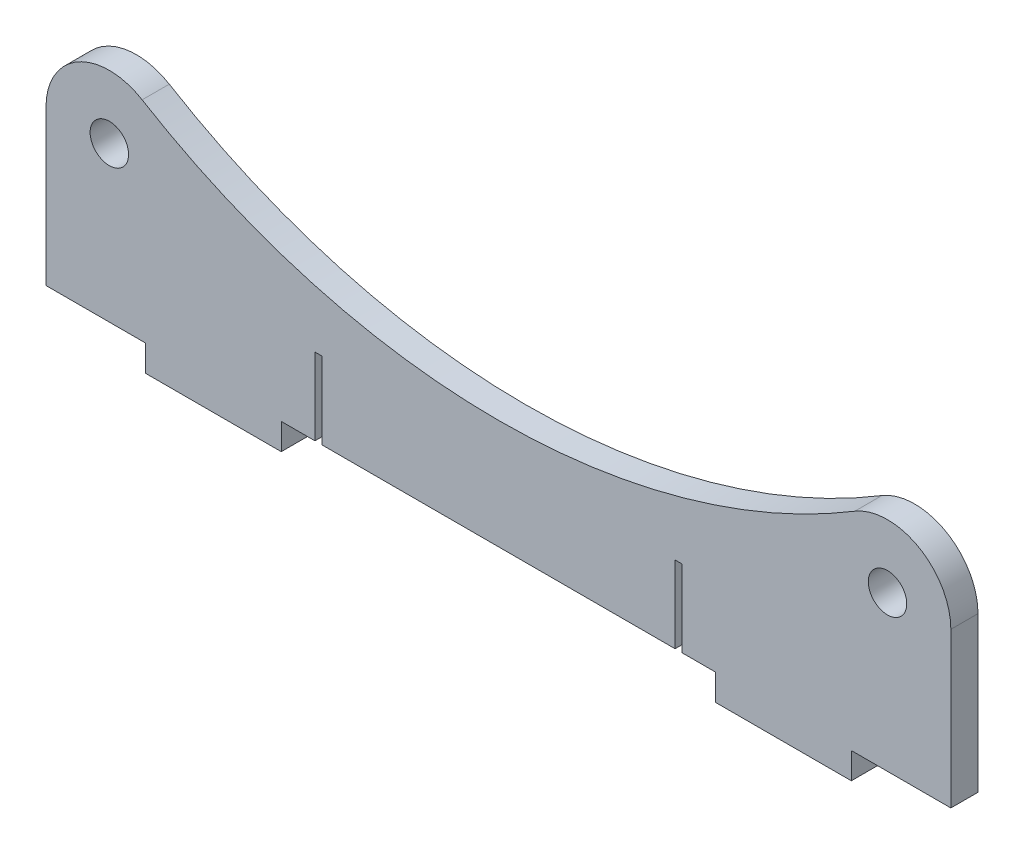
ISO-10303-21;
HEADER;
FILE_DESCRIPTION(('STEP AP214'),'2;1');
FILE_NAME('part.step','',(''),(''),'','','');
FILE_SCHEMA(('AUTOMOTIVE_DESIGN { 1 0 10303 214 1 1 1 1 }'));
ENDSEC;
DATA;
#1=APPLICATION_CONTEXT('core data for automotive mechanical design processes');
#2=APPLICATION_PROTOCOL_DEFINITION('international standard','automotive_design',2000,#1);
#3=PRODUCT_CONTEXT('',#1,'mechanical');
#4=PRODUCT('Part','Part','',(#3));
#5=PRODUCT_RELATED_PRODUCT_CATEGORY('part','',(#4));
#6=PRODUCT_DEFINITION_FORMATION('','',#4);
#7=PRODUCT_DEFINITION_CONTEXT('part definition',#1,'design');
#8=PRODUCT_DEFINITION('design','',#6,#7);
#9=PRODUCT_DEFINITION_SHAPE('','',#8);
#10=(LENGTH_UNIT() NAMED_UNIT(*) SI_UNIT(.MILLI.,.METRE.));
#11=(NAMED_UNIT(*) PLANE_ANGLE_UNIT() SI_UNIT($,.RADIAN.));
#12=(NAMED_UNIT(*) SI_UNIT($,.STERADIAN.) SOLID_ANGLE_UNIT());
#13=UNCERTAINTY_MEASURE_WITH_UNIT(LENGTH_MEASURE(1.E-05),#10,'distance_accuracy_value','');
#14=(GEOMETRIC_REPRESENTATION_CONTEXT(3) GLOBAL_UNCERTAINTY_ASSIGNED_CONTEXT((#13)) GLOBAL_UNIT_ASSIGNED_CONTEXT((#10,
#11,#12)) REPRESENTATION_CONTEXT('',''));
#15=CARTESIAN_POINT('',(0.,0.,0.));
#16=DIRECTION('',(0.,0.,1.));
#17=DIRECTION('',(1.,0.,0.));
#18=AXIS2_PLACEMENT_3D('',#15,#16,#17);
#19=CARTESIAN_POINT('',(0.,-4.20000000000001,6.));
#20=DIRECTION('',(0.,1.,0.));
#21=DIRECTION('',(0.,0.,1.));
#22=AXIS2_PLACEMENT_3D('',#19,#20,#21);
#23=PLANE('',#22);
#24=DIRECTION('',(1.,0.,0.));
#25=VECTOR('',#24,1.);
#26=CARTESIAN_POINT('',(0.,-4.20000000000001,0.));
#27=LINE('',#26,#25);
#28=CARTESIAN_POINT('',(-39.05,-4.20000000000001,0.));
#29=VERTEX_POINT('',#28);
#30=CARTESIAN_POINT('',(39.05,-4.20000000000001,0.));
#31=VERTEX_POINT('',#30);
#32=EDGE_CURVE('E425',#29,#31,#27,.T.);
#33=ORIENTED_EDGE('',*,*,#32,.T.);
#34=DIRECTION('',(0.,0.,1.));
#35=VECTOR('',#34,1.);
#36=CARTESIAN_POINT('',(39.05,-4.20000000000001,6.));
#37=LINE('',#36,#35);
#38=CARTESIAN_POINT('',(39.05,-4.20000000000001,6.));
#39=VERTEX_POINT('',#38);
#40=EDGE_CURVE('E209',#31,#39,#37,.T.);
#41=ORIENTED_EDGE('',*,*,#40,.T.);
#42=DIRECTION('',(1.,0.,0.));
#43=VECTOR('',#42,1.);
#44=CARTESIAN_POINT('',(0.,-4.20000000000001,6.));
#45=LINE('',#44,#43);
#46=CARTESIAN_POINT('',(-39.05,-4.20000000000001,6.));
#47=VERTEX_POINT('',#46);
#48=EDGE_CURVE('E360',#47,#39,#45,.T.);
#49=ORIENTED_EDGE('',*,*,#48,.F.);
#50=DIRECTION('',(0.,0.,-1.));
#51=VECTOR('',#50,1.);
#52=CARTESIAN_POINT('',(-39.05,-4.20000000000001,6.));
#53=LINE('',#52,#51);
#54=EDGE_CURVE('E221',#47,#29,#53,.T.);
#55=ORIENTED_EDGE('',*,*,#54,.T.);
#56=EDGE_LOOP('',(#33,#41,#49,#55));
#57=FACE_BOUND('',#56,.T.);
#58=ADVANCED_FACE('F35',(#57),#23,.F.);
#59=CARTESIAN_POINT('',(-48.,-4.20000000000001,0.));
#60=VERTEX_POINT('',#59);
#61=CARTESIAN_POINT('',(-40.55,-4.20000000000001,0.));
#62=VERTEX_POINT('',#61);
#63=EDGE_CURVE('E281',#60,#62,#27,.T.);
#64=ORIENTED_EDGE('',*,*,#63,.T.);
#65=DIRECTION('',(0.,0.,1.));
#66=VECTOR('',#65,1.);
#67=CARTESIAN_POINT('',(-40.55,-4.20000000000001,6.));
#68=LINE('',#67,#66);
#69=CARTESIAN_POINT('',(-40.55,-4.20000000000001,6.));
#70=VERTEX_POINT('',#69);
#71=EDGE_CURVE('E225',#62,#70,#68,.T.);
#72=ORIENTED_EDGE('',*,*,#71,.T.);
#73=CARTESIAN_POINT('',(-48.,-4.20000000000001,6.));
#74=VERTEX_POINT('',#73);
#75=EDGE_CURVE('E243',#74,#70,#45,.T.);
#76=ORIENTED_EDGE('',*,*,#75,.F.);
#77=DIRECTION('',(0.,0.,-1.));
#78=VECTOR('',#77,1.);
#79=CARTESIAN_POINT('',(-48.,-4.20000000000001,6.));
#80=LINE('',#79,#78);
#81=EDGE_CURVE('E321',#74,#60,#80,.T.);
#82=ORIENTED_EDGE('',*,*,#81,.T.);
#83=EDGE_LOOP('',(#64,#72,#76,#82));
#84=FACE_BOUND('',#83,.T.);
#85=ADVANCED_FACE('F417',(#84),#23,.F.);
#86=CARTESIAN_POINT('',(86.,30.,6.));
#87=DIRECTION('',(0.,0.,-1.));
#88=DIRECTION('',(-1.,0.,0.));
#89=AXIS2_PLACEMENT_3D('',#86,#87,#88);
#90=CYLINDRICAL_SURFACE('',#89,14.);
#91=CARTESIAN_POINT('',(86.,30.,0.));
#92=DIRECTION('',(0.,0.,1.));
#93=DIRECTION('',(1.,0.,0.));
#94=AXIS2_PLACEMENT_3D('',#91,#92,#93);
#95=CIRCLE('',#94,14.);
#96=CARTESIAN_POINT('',(100.,30.,0.));
#97=VERTEX_POINT('',#96);
#98=CARTESIAN_POINT('',(78.7506271951831,41.9769192172604,0.));
#99=VERTEX_POINT('',#98);
#100=EDGE_CURVE('E228',#97,#99,#95,.T.);
#101=ORIENTED_EDGE('',*,*,#100,.T.);
#102=DIRECTION('',(0.,0.,-1.));
#103=VECTOR('',#102,1.);
#104=CARTESIAN_POINT('',(78.7506271951831,41.9769192172604,6.));
#105=LINE('',#104,#103);
#106=CARTESIAN_POINT('',(78.7506271951831,41.9769192172604,6.));
#107=VERTEX_POINT('',#106);
#108=EDGE_CURVE('E337',#107,#99,#105,.T.);
#109=ORIENTED_EDGE('',*,*,#108,.F.);
#110=CARTESIAN_POINT('',(86.,30.,6.));
#111=DIRECTION('',(0.,0.,1.));
#112=DIRECTION('',(1.,0.,0.));
#113=AXIS2_PLACEMENT_3D('',#110,#111,#112);
#114=CIRCLE('',#113,14.);
#115=CARTESIAN_POINT('',(100.,30.,6.));
#116=VERTEX_POINT('',#115);
#117=EDGE_CURVE('E229',#116,#107,#114,.T.);
#118=ORIENTED_EDGE('',*,*,#117,.F.);
#119=DIRECTION('',(0.,0.,-1.));
#120=VECTOR('',#119,1.);
#121=CARTESIAN_POINT('',(100.,30.,6.));
#122=LINE('',#121,#120);
#123=EDGE_CURVE('E266',#116,#97,#122,.T.);
#124=ORIENTED_EDGE('',*,*,#123,.T.);
#125=EDGE_LOOP('',(#101,#109,#118,#124));
#126=FACE_BOUND('',#125,.T.);
#127=ADVANCED_FACE('F37',(#126),#90,.T.);
#128=CARTESIAN_POINT('',(0.,172.083333333333,6.));
#129=DIRECTION('',(0.,0.,-1.));
#130=DIRECTION('',(-1.,0.,0.));
#131=AXIS2_PLACEMENT_3D('',#128,#129,#130);
#132=CYLINDRICAL_SURFACE('',#131,152.083333333333);
#133=CARTESIAN_POINT('',(0.,172.083333333333,0.));
#134=DIRECTION('',(0.,0.,1.));
#135=DIRECTION('',(1.,0.,0.));
#136=AXIS2_PLACEMENT_3D('',#133,#134,#135);
#137=CIRCLE('',#136,152.083333333333);
#138=CARTESIAN_POINT('',(-78.7506271951831,41.9769192172604,0.));
#139=VERTEX_POINT('',#138);
#140=EDGE_CURVE('E269',#139,#99,#137,.T.);
#141=ORIENTED_EDGE('',*,*,#140,.F.);
#142=DIRECTION('',(0.,0.,-1.));
#143=VECTOR('',#142,1.);
#144=CARTESIAN_POINT('',(-78.7506271951831,41.9769192172604,6.));
#145=LINE('',#144,#143);
#146=CARTESIAN_POINT('',(-78.7506271951831,41.9769192172604,6.));
#147=VERTEX_POINT('',#146);
#148=EDGE_CURVE('E335',#147,#139,#145,.T.);
#149=ORIENTED_EDGE('',*,*,#148,.F.);
#150=CARTESIAN_POINT('',(0.,172.083333333333,6.));
#151=DIRECTION('',(0.,0.,1.));
#152=DIRECTION('',(1.,0.,0.));
#153=AXIS2_PLACEMENT_3D('',#150,#151,#152);
#154=CIRCLE('',#153,152.083333333333);
#155=EDGE_CURVE('E231',#147,#107,#154,.T.);
#156=ORIENTED_EDGE('',*,*,#155,.T.);
#157=ORIENTED_EDGE('',*,*,#108,.T.);
#158=EDGE_LOOP('',(#141,#149,#156,#157));
#159=FACE_BOUND('',#158,.T.);
#160=ADVANCED_FACE('F385',(#159),#132,.F.);
#161=CARTESIAN_POINT('',(-86.,30.,6.));
#162=DIRECTION('',(0.,0.,-1.));
#163=DIRECTION('',(-1.,0.,0.));
#164=AXIS2_PLACEMENT_3D('',#161,#162,#163);
#165=CYLINDRICAL_SURFACE('',#164,14.);
#166=CARTESIAN_POINT('',(-86.,30.,0.));
#167=DIRECTION('',(0.,0.,1.));
#168=DIRECTION('',(1.,0.,0.));
#169=AXIS2_PLACEMENT_3D('',#166,#167,#168);
#170=CIRCLE('',#169,14.);
#171=CARTESIAN_POINT('',(-100.,30.,0.));
#172=VERTEX_POINT('',#171);
#173=EDGE_CURVE('E272',#139,#172,#170,.T.);
#174=ORIENTED_EDGE('',*,*,#173,.T.);
#175=DIRECTION('',(0.,0.,-1.));
#176=VECTOR('',#175,1.);
#177=CARTESIAN_POINT('',(-100.,30.,6.));
#178=LINE('',#177,#176);
#179=CARTESIAN_POINT('',(-100.,30.,6.));
#180=VERTEX_POINT('',#179);
#181=EDGE_CURVE('E332',#180,#172,#178,.T.);
#182=ORIENTED_EDGE('',*,*,#181,.F.);
#183=CARTESIAN_POINT('',(-86.,30.,6.));
#184=DIRECTION('',(0.,0.,1.));
#185=DIRECTION('',(1.,0.,0.));
#186=AXIS2_PLACEMENT_3D('',#183,#184,#185);
#187=CIRCLE('',#186,14.);
#188=EDGE_CURVE('E235',#147,#180,#187,.T.);
#189=ORIENTED_EDGE('',*,*,#188,.F.);
#190=ORIENTED_EDGE('',*,*,#148,.T.);
#191=EDGE_LOOP('',(#174,#182,#189,#190));
#192=FACE_BOUND('',#191,.T.);
#193=ADVANCED_FACE('F388',(#192),#165,.T.);
#194=CARTESIAN_POINT('',(-100.,0.,6.));
#195=DIRECTION('',(1.,0.,0.));
#196=DIRECTION('',(0.,0.,-1.));
#197=AXIS2_PLACEMENT_3D('',#194,#195,#196);
#198=PLANE('',#197);
#199=DIRECTION('',(0.,-1.,0.));
#200=VECTOR('',#199,1.);
#201=CARTESIAN_POINT('',(-100.,0.,0.));
#202=LINE('',#201,#200);
#203=CARTESIAN_POINT('',(-100.,-4.20000000000001,0.));
#204=VERTEX_POINT('',#203);
#205=EDGE_CURVE('E274',#172,#204,#202,.T.);
#206=ORIENTED_EDGE('',*,*,#205,.T.);
#207=DIRECTION('',(0.,0.,-1.));
#208=VECTOR('',#207,1.);
#209=CARTESIAN_POINT('',(-100.,-4.20000000000001,6.));
#210=LINE('',#209,#208);
#211=CARTESIAN_POINT('',(-100.,-4.20000000000001,6.));
#212=VERTEX_POINT('',#211);
#213=EDGE_CURVE('E329',#212,#204,#210,.T.);
#214=ORIENTED_EDGE('',*,*,#213,.F.);
#215=DIRECTION('',(0.,-1.,0.));
#216=VECTOR('',#215,1.);
#217=CARTESIAN_POINT('',(-100.,0.,6.));
#218=LINE('',#217,#216);
#219=EDGE_CURVE('E237',#180,#212,#218,.T.);
#220=ORIENTED_EDGE('',*,*,#219,.F.);
#221=ORIENTED_EDGE('',*,*,#181,.T.);
#222=EDGE_LOOP('',(#206,#214,#220,#221));
#223=FACE_BOUND('',#222,.T.);
#224=ADVANCED_FACE('F393',(#223),#198,.F.);
#225=CARTESIAN_POINT('',(-78.,-4.20000000000001,0.));
#226=VERTEX_POINT('',#225);
#227=EDGE_CURVE('E276',#204,#226,#27,.T.);
#228=ORIENTED_EDGE('',*,*,#227,.T.);
#229=DIRECTION('',(0.,0.,-1.));
#230=VECTOR('',#229,1.);
#231=CARTESIAN_POINT('',(-78.,-4.20000000000001,6.));
#232=LINE('',#231,#230);
#233=CARTESIAN_POINT('',(-78.,-4.20000000000001,6.));
#234=VERTEX_POINT('',#233);
#235=EDGE_CURVE('E327',#234,#226,#232,.T.);
#236=ORIENTED_EDGE('',*,*,#235,.F.);
#237=EDGE_CURVE('E239',#212,#234,#45,.T.);
#238=ORIENTED_EDGE('',*,*,#237,.F.);
#239=ORIENTED_EDGE('',*,*,#213,.T.);
#240=EDGE_LOOP('',(#228,#236,#238,#239));
#241=FACE_BOUND('',#240,.T.);
#242=ADVANCED_FACE('F398',(#241),#23,.F.);
#243=CARTESIAN_POINT('',(-78.,1.86632318794746E-13,6.));
#244=DIRECTION('',(-1.,0.,0.));
#245=DIRECTION('',(0.,-1.,0.));
#246=AXIS2_PLACEMENT_3D('',#243,#244,#245);
#247=PLANE('',#246);
#248=DIRECTION('',(0.,1.,0.));
#249=VECTOR('',#248,1.);
#250=CARTESIAN_POINT('',(-78.,1.86632318794746E-13,0.));
#251=LINE('',#250,#249);
#252=CARTESIAN_POINT('',(-78.,-10.,0.));
#253=VERTEX_POINT('',#252);
#254=EDGE_CURVE('E279',#253,#226,#251,.T.);
#255=ORIENTED_EDGE('',*,*,#254,.F.);
#256=DIRECTION('',(0.,0.,-1.));
#257=VECTOR('',#256,1.);
#258=CARTESIAN_POINT('',(-78.,-10.,6.));
#259=LINE('',#258,#257);
#260=CARTESIAN_POINT('',(-78.,-10.,6.));
#261=VERTEX_POINT('',#260);
#262=EDGE_CURVE('E325',#261,#253,#259,.T.);
#263=ORIENTED_EDGE('',*,*,#262,.F.);
#264=DIRECTION('',(0.,1.,0.));
#265=VECTOR('',#264,1.);
#266=CARTESIAN_POINT('',(-78.,1.86632318794746E-13,6.));
#267=LINE('',#266,#265);
#268=EDGE_CURVE('E241',#261,#234,#267,.T.);
#269=ORIENTED_EDGE('',*,*,#268,.T.);
#270=ORIENTED_EDGE('',*,*,#235,.T.);
#271=EDGE_LOOP('',(#255,#263,#269,#270));
#272=FACE_BOUND('',#271,.T.);
#273=ADVANCED_FACE('F402',(#272),#247,.T.);
#274=CARTESIAN_POINT('',(0.,-10.,6.));
#275=DIRECTION('',(0.,1.,0.));
#276=DIRECTION('',(-1.,0.,0.));
#277=AXIS2_PLACEMENT_3D('',#274,#275,#276);
#278=PLANE('',#277);
#279=DIRECTION('',(1.,0.,0.));
#280=VECTOR('',#279,1.);
#281=CARTESIAN_POINT('',(0.,-10.,0.));
#282=LINE('',#281,#280);
#283=CARTESIAN_POINT('',(-48.,-10.,0.));
#284=VERTEX_POINT('',#283);
#285=EDGE_CURVE('E284',#253,#284,#282,.T.);
#286=ORIENTED_EDGE('',*,*,#285,.T.);
#287=DIRECTION('',(0.,0.,-1.));
#288=VECTOR('',#287,1.);
#289=CARTESIAN_POINT('',(-48.,-10.,6.));
#290=LINE('',#289,#288);
#291=CARTESIAN_POINT('',(-48.,-10.,6.));
#292=VERTEX_POINT('',#291);
#293=EDGE_CURVE('E323',#292,#284,#290,.T.);
#294=ORIENTED_EDGE('',*,*,#293,.F.);
#295=DIRECTION('',(1.,0.,0.));
#296=VECTOR('',#295,1.);
#297=CARTESIAN_POINT('',(0.,-10.,6.));
#298=LINE('',#297,#296);
#299=EDGE_CURVE('E246',#261,#292,#298,.T.);
#300=ORIENTED_EDGE('',*,*,#299,.F.);
#301=ORIENTED_EDGE('',*,*,#262,.T.);
#302=EDGE_LOOP('',(#286,#294,#300,#301));
#303=FACE_BOUND('',#302,.T.);
#304=ADVANCED_FACE('F407',(#303),#278,.F.);
#305=CARTESIAN_POINT('',(-48.,0.,6.));
#306=DIRECTION('',(1.,0.,0.));
#307=DIRECTION('',(0.,0.,-1.));
#308=AXIS2_PLACEMENT_3D('',#305,#306,#307);
#309=PLANE('',#308);
#310=DIRECTION('',(0.,-1.,0.));
#311=VECTOR('',#310,1.);
#312=CARTESIAN_POINT('',(-48.,0.,0.));
#313=LINE('',#312,#311);
#314=EDGE_CURVE('E287',#60,#284,#313,.T.);
#315=ORIENTED_EDGE('',*,*,#314,.F.);
#316=ORIENTED_EDGE('',*,*,#81,.F.);
#317=DIRECTION('',(0.,-1.,0.));
#318=VECTOR('',#317,1.);
#319=CARTESIAN_POINT('',(-48.,0.,6.));
#320=LINE('',#319,#318);
#321=EDGE_CURVE('E248',#74,#292,#320,.T.);
#322=ORIENTED_EDGE('',*,*,#321,.T.);
#323=ORIENTED_EDGE('',*,*,#293,.T.);
#324=EDGE_LOOP('',(#315,#316,#322,#323));
#325=FACE_BOUND('',#324,.T.);
#326=ADVANCED_FACE('F413',(#325),#309,.T.);
#327=CARTESIAN_POINT('',(40.55,-4.20000000000001,6.));
#328=VERTEX_POINT('',#327);
#329=CARTESIAN_POINT('',(48.,-4.20000000000001,6.));
#330=VERTEX_POINT('',#329);
#331=EDGE_CURVE('E242',#328,#330,#45,.T.);
#332=ORIENTED_EDGE('',*,*,#331,.F.);
#333=DIRECTION('',(0.,0.,-1.));
#334=VECTOR('',#333,1.);
#335=CARTESIAN_POINT('',(40.55,-4.20000000000001,6.));
#336=LINE('',#335,#334);
#337=CARTESIAN_POINT('',(40.55,-4.20000000000001,0.));
#338=VERTEX_POINT('',#337);
#339=EDGE_CURVE('E196',#328,#338,#336,.T.);
#340=ORIENTED_EDGE('',*,*,#339,.T.);
#341=CARTESIAN_POINT('',(48.,-4.20000000000001,0.));
#342=VERTEX_POINT('',#341);
#343=EDGE_CURVE('E280',#338,#342,#27,.T.);
#344=ORIENTED_EDGE('',*,*,#343,.T.);
#345=DIRECTION('',(0.,0.,-1.));
#346=VECTOR('',#345,1.);
#347=CARTESIAN_POINT('',(48.,-4.20000000000001,6.));
#348=LINE('',#347,#346);
#349=EDGE_CURVE('E318',#330,#342,#348,.T.);
#350=ORIENTED_EDGE('',*,*,#349,.F.);
#351=EDGE_LOOP('',(#332,#340,#344,#350));
#352=FACE_BOUND('',#351,.T.);
#353=ADVANCED_FACE('F357',(#352),#23,.F.);
#354=CARTESIAN_POINT('',(48.,0.,6.));
#355=DIRECTION('',(1.,0.,0.));
#356=DIRECTION('',(0.,0.,-1.));
#357=AXIS2_PLACEMENT_3D('',#354,#355,#356);
#358=PLANE('',#357);
#359=DIRECTION('',(0.,-1.,0.));
#360=VECTOR('',#359,1.);
#361=CARTESIAN_POINT('',(48.,0.,0.));
#362=LINE('',#361,#360);
#363=CARTESIAN_POINT('',(48.,-10.,0.));
#364=VERTEX_POINT('',#363);
#365=EDGE_CURVE('E290',#342,#364,#362,.T.);
#366=ORIENTED_EDGE('',*,*,#365,.T.);
#367=DIRECTION('',(0.,0.,-1.));
#368=VECTOR('',#367,1.);
#369=CARTESIAN_POINT('',(48.,-10.,6.));
#370=LINE('',#369,#368);
#371=CARTESIAN_POINT('',(48.,-10.,6.));
#372=VERTEX_POINT('',#371);
#373=EDGE_CURVE('E315',#372,#364,#370,.T.);
#374=ORIENTED_EDGE('',*,*,#373,.F.);
#375=DIRECTION('',(0.,-1.,0.));
#376=VECTOR('',#375,1.);
#377=CARTESIAN_POINT('',(48.,0.,6.));
#378=LINE('',#377,#376);
#379=EDGE_CURVE('E251',#330,#372,#378,.T.);
#380=ORIENTED_EDGE('',*,*,#379,.F.);
#381=ORIENTED_EDGE('',*,*,#349,.T.);
#382=EDGE_LOOP('',(#366,#374,#380,#381));
#383=FACE_BOUND('',#382,.T.);
#384=ADVANCED_FACE('F459',(#383),#358,.F.);
#385=CARTESIAN_POINT('',(0.,-10.,6.));
#386=DIRECTION('',(0.,1.,0.));
#387=DIRECTION('',(-1.,0.,0.));
#388=AXIS2_PLACEMENT_3D('',#385,#386,#387);
#389=PLANE('',#388);
#390=DIRECTION('',(1.,0.,0.));
#391=VECTOR('',#390,1.);
#392=CARTESIAN_POINT('',(0.,-10.,0.));
#393=LINE('',#392,#391);
#394=CARTESIAN_POINT('',(78.,-10.,0.));
#395=VERTEX_POINT('',#394);
#396=EDGE_CURVE('E292',#364,#395,#393,.T.);
#397=ORIENTED_EDGE('',*,*,#396,.T.);
#398=DIRECTION('',(0.,0.,-1.));
#399=VECTOR('',#398,1.);
#400=CARTESIAN_POINT('',(78.,-10.,6.));
#401=LINE('',#400,#399);
#402=CARTESIAN_POINT('',(78.,-10.,6.));
#403=VERTEX_POINT('',#402);
#404=EDGE_CURVE('E312',#403,#395,#401,.T.);
#405=ORIENTED_EDGE('',*,*,#404,.F.);
#406=DIRECTION('',(1.,0.,0.));
#407=VECTOR('',#406,1.);
#408=CARTESIAN_POINT('',(0.,-10.,6.));
#409=LINE('',#408,#407);
#410=EDGE_CURVE('E253',#372,#403,#409,.T.);
#411=ORIENTED_EDGE('',*,*,#410,.F.);
#412=ORIENTED_EDGE('',*,*,#373,.T.);
#413=EDGE_LOOP('',(#397,#405,#411,#412));
#414=FACE_BOUND('',#413,.T.);
#415=ADVANCED_FACE('F456',(#414),#389,.F.);
#416=CARTESIAN_POINT('',(78.,1.86632318794746E-13,6.));
#417=DIRECTION('',(-1.,0.,0.));
#418=DIRECTION('',(0.,-1.,0.));
#419=AXIS2_PLACEMENT_3D('',#416,#417,#418);
#420=PLANE('',#419);
#421=DIRECTION('',(0.,1.,0.));
#422=VECTOR('',#421,1.);
#423=CARTESIAN_POINT('',(78.,1.86632318794746E-13,0.));
#424=LINE('',#423,#422);
#425=CARTESIAN_POINT('',(78.,-4.20000000000001,0.));
#426=VERTEX_POINT('',#425);
#427=EDGE_CURVE('E294',#395,#426,#424,.T.);
#428=ORIENTED_EDGE('',*,*,#427,.T.);
#429=DIRECTION('',(0.,0.,-1.));
#430=VECTOR('',#429,1.);
#431=CARTESIAN_POINT('',(78.,-4.20000000000001,6.));
#432=LINE('',#431,#430);
#433=CARTESIAN_POINT('',(78.,-4.20000000000001,6.));
#434=VERTEX_POINT('',#433);
#435=EDGE_CURVE('E309',#434,#426,#432,.T.);
#436=ORIENTED_EDGE('',*,*,#435,.F.);
#437=DIRECTION('',(0.,1.,0.));
#438=VECTOR('',#437,1.);
#439=CARTESIAN_POINT('',(78.,1.86632318794746E-13,6.));
#440=LINE('',#439,#438);
#441=EDGE_CURVE('E255',#403,#434,#440,.T.);
#442=ORIENTED_EDGE('',*,*,#441,.F.);
#443=ORIENTED_EDGE('',*,*,#404,.T.);
#444=EDGE_LOOP('',(#428,#436,#442,#443));
#445=FACE_BOUND('',#444,.T.);
#446=ADVANCED_FACE('F449',(#445),#420,.F.);
#447=CARTESIAN_POINT('',(100.,-4.20000000000001,0.));
#448=VERTEX_POINT('',#447);
#449=EDGE_CURVE('E296',#426,#448,#27,.T.);
#450=ORIENTED_EDGE('',*,*,#449,.T.);
#451=DIRECTION('',(0.,0.,-1.));
#452=VECTOR('',#451,1.);
#453=CARTESIAN_POINT('',(100.,-4.20000000000001,6.));
#454=LINE('',#453,#452);
#455=CARTESIAN_POINT('',(100.,-4.20000000000001,6.));
#456=VERTEX_POINT('',#455);
#457=EDGE_CURVE('E306',#456,#448,#454,.T.);
#458=ORIENTED_EDGE('',*,*,#457,.F.);
#459=EDGE_CURVE('E257',#434,#456,#45,.T.);
#460=ORIENTED_EDGE('',*,*,#459,.F.);
#461=ORIENTED_EDGE('',*,*,#435,.T.);
#462=EDGE_LOOP('',(#450,#458,#460,#461));
#463=FACE_BOUND('',#462,.T.);
#464=ADVANCED_FACE('F371',(#463),#23,.F.);
#465=CARTESIAN_POINT('',(-86.,30.,6.));
#466=DIRECTION('',(0.,0.,-1.));
#467=DIRECTION('',(-1.,0.,0.));
#468=AXIS2_PLACEMENT_3D('',#465,#466,#467);
#469=CYLINDRICAL_SURFACE('',#468,4.25);
#470=CARTESIAN_POINT('',(-86.,30.,6.));
#471=DIRECTION('',(0.,0.,1.));
#472=DIRECTION('',(1.,0.,0.));
#473=AXIS2_PLACEMENT_3D('',#470,#471,#472);
#474=CIRCLE('',#473,4.25);
#475=CARTESIAN_POINT('',(-81.75,30.,6.));
#476=VERTEX_POINT('',#475);
#477=EDGE_CURVE('E260',#476,#476,#474,.T.);
#478=ORIENTED_EDGE('',*,*,#477,.T.);
#479=EDGE_LOOP('',(#478));
#480=FACE_BOUND('',#479,.T.);
#481=CARTESIAN_POINT('',(-86.,30.,0.));
#482=DIRECTION('',(0.,0.,1.));
#483=DIRECTION('',(1.,0.,0.));
#484=AXIS2_PLACEMENT_3D('',#481,#482,#483);
#485=CIRCLE('',#484,4.25);
#486=CARTESIAN_POINT('',(-81.75,30.,0.));
#487=VERTEX_POINT('',#486);
#488=EDGE_CURVE('E299',#487,#487,#485,.T.);
#489=ORIENTED_EDGE('',*,*,#488,.F.);
#490=EDGE_LOOP('',(#489));
#491=FACE_BOUND('',#490,.T.);
#492=ADVANCED_FACE('F448',(#480,#491),#469,.F.);
#493=CARTESIAN_POINT('',(100.,0.,6.));
#494=DIRECTION('',(-1.,0.,0.));
#495=DIRECTION('',(0.,-1.,0.));
#496=AXIS2_PLACEMENT_3D('',#493,#494,#495);
#497=PLANE('',#496);
#498=DIRECTION('',(0.,1.,0.));
#499=VECTOR('',#498,1.);
#500=CARTESIAN_POINT('',(100.,0.,0.));
#501=LINE('',#500,#499);
#502=EDGE_CURVE('E297',#448,#97,#501,.T.);
#503=ORIENTED_EDGE('',*,*,#502,.T.);
#504=ORIENTED_EDGE('',*,*,#123,.F.);
#505=DIRECTION('',(0.,1.,0.));
#506=VECTOR('',#505,1.);
#507=CARTESIAN_POINT('',(100.,0.,6.));
#508=LINE('',#507,#506);
#509=EDGE_CURVE('E258',#456,#116,#508,.T.);
#510=ORIENTED_EDGE('',*,*,#509,.F.);
#511=ORIENTED_EDGE('',*,*,#457,.T.);
#512=EDGE_LOOP('',(#503,#504,#510,#511));
#513=FACE_BOUND('',#512,.T.);
#514=ADVANCED_FACE('F375',(#513),#497,.F.);
#515=CARTESIAN_POINT('',(86.,30.,6.));
#516=DIRECTION('',(0.,0.,-1.));
#517=DIRECTION('',(-1.,0.,0.));
#518=AXIS2_PLACEMENT_3D('',#515,#516,#517);
#519=CYLINDRICAL_SURFACE('',#518,4.25);
#520=CARTESIAN_POINT('',(86.,30.,6.));
#521=DIRECTION('',(0.,0.,1.));
#522=DIRECTION('',(1.,0.,0.));
#523=AXIS2_PLACEMENT_3D('',#520,#521,#522);
#524=CIRCLE('',#523,4.25);
#525=CARTESIAN_POINT('',(90.25,30.,6.));
#526=VERTEX_POINT('',#525);
#527=EDGE_CURVE('E263',#526,#526,#524,.T.);
#528=ORIENTED_EDGE('',*,*,#527,.T.);
#529=EDGE_LOOP('',(#528));
#530=FACE_BOUND('',#529,.T.);
#531=CARTESIAN_POINT('',(86.,30.,0.));
#532=DIRECTION('',(0.,0.,1.));
#533=DIRECTION('',(1.,0.,0.));
#534=AXIS2_PLACEMENT_3D('',#531,#532,#533);
#535=CIRCLE('',#534,4.25);
#536=CARTESIAN_POINT('',(90.25,30.,0.));
#537=VERTEX_POINT('',#536);
#538=EDGE_CURVE('E232',#537,#537,#535,.T.);
#539=ORIENTED_EDGE('',*,*,#538,.F.);
#540=EDGE_LOOP('',(#539));
#541=FACE_BOUND('',#540,.T.);
#542=ADVANCED_FACE('F568',(#530,#541),#519,.F.);
#543=CARTESIAN_POINT('',(0.,0.,6.));
#544=DIRECTION('',(0.,0.,1.));
#545=DIRECTION('',(1.,0.,0.));
#546=AXIS2_PLACEMENT_3D('',#543,#544,#545);
#547=PLANE('',#546);
#548=DIRECTION('',(0.,-1.,0.));
#549=VECTOR('',#548,1.);
#550=CARTESIAN_POINT('',(39.05,-7.19999999999994,6.));
#551=LINE('',#550,#549);
#552=CARTESIAN_POINT('',(39.05,12.8000000000001,6.));
#553=VERTEX_POINT('',#552);
#554=EDGE_CURVE('E199',#553,#39,#551,.T.);
#555=ORIENTED_EDGE('',*,*,#554,.F.);
#556=DIRECTION('',(-1.,0.,0.));
#557=VECTOR('',#556,1.);
#558=CARTESIAN_POINT('',(40.55,12.8000000000001,6.));
#559=LINE('',#558,#557);
#560=CARTESIAN_POINT('',(40.55,12.8000000000001,6.));
#561=VERTEX_POINT('',#560);
#562=EDGE_CURVE('E186',#561,#553,#559,.T.);
#563=ORIENTED_EDGE('',*,*,#562,.F.);
#564=DIRECTION('',(0.,1.,0.));
#565=VECTOR('',#564,1.);
#566=CARTESIAN_POINT('',(40.55,-7.19999999999994,6.));
#567=LINE('',#566,#565);
#568=EDGE_CURVE('E193',#328,#561,#567,.T.);
#569=ORIENTED_EDGE('',*,*,#568,.F.);
#570=ORIENTED_EDGE('',*,*,#331,.T.);
#571=ORIENTED_EDGE('',*,*,#379,.T.);
#572=ORIENTED_EDGE('',*,*,#410,.T.);
#573=ORIENTED_EDGE('',*,*,#441,.T.);
#574=ORIENTED_EDGE('',*,*,#459,.T.);
#575=ORIENTED_EDGE('',*,*,#509,.T.);
#576=ORIENTED_EDGE('',*,*,#117,.T.);
#577=ORIENTED_EDGE('',*,*,#155,.F.);
#578=ORIENTED_EDGE('',*,*,#188,.T.);
#579=ORIENTED_EDGE('',*,*,#219,.T.);
#580=ORIENTED_EDGE('',*,*,#237,.T.);
#581=ORIENTED_EDGE('',*,*,#268,.F.);
#582=ORIENTED_EDGE('',*,*,#299,.T.);
#583=ORIENTED_EDGE('',*,*,#321,.F.);
#584=ORIENTED_EDGE('',*,*,#75,.T.);
#585=DIRECTION('',(0.,-1.,0.));
#586=VECTOR('',#585,1.);
#587=CARTESIAN_POINT('',(-40.55,-7.19999999999996,6.));
#588=LINE('',#587,#586);
#589=CARTESIAN_POINT('',(-40.55,12.8,6.));
#590=VERTEX_POINT('',#589);
#591=EDGE_CURVE('E217',#590,#70,#588,.T.);
#592=ORIENTED_EDGE('',*,*,#591,.F.);
#593=DIRECTION('',(-1.,0.,0.));
#594=VECTOR('',#593,1.);
#595=CARTESIAN_POINT('',(-40.55,12.8,6.));
#596=LINE('',#595,#594);
#597=CARTESIAN_POINT('',(-39.05,12.8,6.));
#598=VERTEX_POINT('',#597);
#599=EDGE_CURVE('E214',#598,#590,#596,.T.);
#600=ORIENTED_EDGE('',*,*,#599,.F.);
#601=DIRECTION('',(0.,1.,0.));
#602=VECTOR('',#601,1.);
#603=CARTESIAN_POINT('',(-39.05,-7.19999999999996,6.));
#604=LINE('',#603,#602);
#605=EDGE_CURVE('E212',#47,#598,#604,.T.);
#606=ORIENTED_EDGE('',*,*,#605,.F.);
#607=ORIENTED_EDGE('',*,*,#48,.T.);
#608=EDGE_LOOP('',(#555,#563,#569,#570,#571,#572,#573,#574,#575,#576,#577,#578,#579,#580,#581,
#582,#583,#584,#592,#600,#606,#607));
#609=FACE_BOUND('',#608,.T.);
#610=ORIENTED_EDGE('',*,*,#477,.F.);
#611=EDGE_LOOP('',(#610));
#612=FACE_BOUND('',#611,.T.);
#613=ORIENTED_EDGE('',*,*,#527,.F.);
#614=EDGE_LOOP('',(#613));
#615=FACE_BOUND('',#614,.T.);
#616=ADVANCED_FACE('F201',(#609,#612,#615),#547,.T.);
#617=CARTESIAN_POINT('',(0.,0.,0.));
#618=DIRECTION('',(0.,0.,1.));
#619=DIRECTION('',(1.,0.,0.));
#620=AXIS2_PLACEMENT_3D('',#617,#618,#619);
#621=PLANE('',#620);
#622=DIRECTION('',(-1.,0.,0.));
#623=VECTOR('',#622,1.);
#624=CARTESIAN_POINT('',(0.,12.8000000000001,0.));
#625=LINE('',#624,#623);
#626=CARTESIAN_POINT('',(40.55,12.8000000000001,0.));
#627=VERTEX_POINT('',#626);
#628=CARTESIAN_POINT('',(39.05,12.8000000000001,0.));
#629=VERTEX_POINT('',#628);
#630=EDGE_CURVE('E43',#627,#629,#625,.T.);
#631=ORIENTED_EDGE('',*,*,#630,.T.);
#632=DIRECTION('',(0.,-1.,0.));
#633=VECTOR('',#632,1.);
#634=CARTESIAN_POINT('',(39.05,0.,0.));
#635=LINE('',#634,#633);
#636=EDGE_CURVE('E11',#629,#31,#635,.T.);
#637=ORIENTED_EDGE('',*,*,#636,.T.);
#638=ORIENTED_EDGE('',*,*,#32,.F.);
#639=DIRECTION('',(0.,1.,0.));
#640=VECTOR('',#639,1.);
#641=CARTESIAN_POINT('',(-39.05,0.,0.));
#642=LINE('',#641,#640);
#643=CARTESIAN_POINT('',(-39.05,12.8,0.));
#644=VERTEX_POINT('',#643);
#645=EDGE_CURVE('E339',#29,#644,#642,.T.);
#646=ORIENTED_EDGE('',*,*,#645,.T.);
#647=DIRECTION('',(-1.,0.,0.));
#648=VECTOR('',#647,1.);
#649=CARTESIAN_POINT('',(0.,12.8,0.));
#650=LINE('',#649,#648);
#651=CARTESIAN_POINT('',(-40.55,12.8,0.));
#652=VERTEX_POINT('',#651);
#653=EDGE_CURVE('E342',#644,#652,#650,.T.);
#654=ORIENTED_EDGE('',*,*,#653,.T.);
#655=DIRECTION('',(0.,-1.,0.));
#656=VECTOR('',#655,1.);
#657=CARTESIAN_POINT('',(-40.55,0.,0.));
#658=LINE('',#657,#656);
#659=EDGE_CURVE('E345',#652,#62,#658,.T.);
#660=ORIENTED_EDGE('',*,*,#659,.T.);
#661=ORIENTED_EDGE('',*,*,#63,.F.);
#662=ORIENTED_EDGE('',*,*,#314,.T.);
#663=ORIENTED_EDGE('',*,*,#285,.F.);
#664=ORIENTED_EDGE('',*,*,#254,.T.);
#665=ORIENTED_EDGE('',*,*,#227,.F.);
#666=ORIENTED_EDGE('',*,*,#205,.F.);
#667=ORIENTED_EDGE('',*,*,#173,.F.);
#668=ORIENTED_EDGE('',*,*,#140,.T.);
#669=ORIENTED_EDGE('',*,*,#100,.F.);
#670=ORIENTED_EDGE('',*,*,#502,.F.);
#671=ORIENTED_EDGE('',*,*,#449,.F.);
#672=ORIENTED_EDGE('',*,*,#427,.F.);
#673=ORIENTED_EDGE('',*,*,#396,.F.);
#674=ORIENTED_EDGE('',*,*,#365,.F.);
#675=ORIENTED_EDGE('',*,*,#343,.F.);
#676=DIRECTION('',(0.,1.,0.));
#677=VECTOR('',#676,1.);
#678=CARTESIAN_POINT('',(40.55,0.,0.));
#679=LINE('',#678,#677);
#680=EDGE_CURVE('E348',#338,#627,#679,.T.);
#681=ORIENTED_EDGE('',*,*,#680,.T.);
#682=EDGE_LOOP('',(#631,#637,#638,#646,#654,#660,#661,#662,#663,#664,#665,#666,#667,#668,#669,
#670,#671,#672,#673,#674,#675,#681));
#683=FACE_BOUND('',#682,.T.);
#684=ORIENTED_EDGE('',*,*,#488,.T.);
#685=EDGE_LOOP('',(#684));
#686=FACE_BOUND('',#685,.T.);
#687=ORIENTED_EDGE('',*,*,#538,.T.);
#688=EDGE_LOOP('',(#687));
#689=FACE_BOUND('',#688,.T.);
#690=ADVANCED_FACE('F350',(#683,#686,#689),#621,.F.);
#691=CARTESIAN_POINT('',(-40.55,-7.19999999999996,-19.5));
#692=DIRECTION('',(-1.,0.,0.));
#693=DIRECTION('',(0.,0.,1.));
#694=AXIS2_PLACEMENT_3D('',#691,#692,#693);
#695=PLANE('',#694);
#696=ORIENTED_EDGE('',*,*,#659,.F.);
#697=DIRECTION('',(0.,0.,1.));
#698=VECTOR('',#697,1.);
#699=CARTESIAN_POINT('',(-40.55,12.8,-19.5));
#700=LINE('',#699,#698);
#701=EDGE_CURVE('E219',#652,#590,#700,.T.);
#702=ORIENTED_EDGE('',*,*,#701,.T.);
#703=ORIENTED_EDGE('',*,*,#591,.T.);
#704=ORIENTED_EDGE('',*,*,#71,.F.);
#705=EDGE_LOOP('',(#696,#702,#703,#704));
#706=FACE_BOUND('',#705,.T.);
#707=ADVANCED_FACE('F419',(#706),#695,.F.);
#708=CARTESIAN_POINT('',(-40.55,12.8,-19.5));
#709=DIRECTION('',(0.,1.,0.));
#710=DIRECTION('',(0.,0.,1.));
#711=AXIS2_PLACEMENT_3D('',#708,#709,#710);
#712=PLANE('',#711);
#713=DIRECTION('',(0.,0.,1.));
#714=VECTOR('',#713,1.);
#715=CARTESIAN_POINT('',(-39.05,12.8,-19.5));
#716=LINE('',#715,#714);
#717=EDGE_CURVE('E58',#644,#598,#716,.T.);
#718=ORIENTED_EDGE('',*,*,#717,.T.);
#719=ORIENTED_EDGE('',*,*,#599,.T.);
#720=ORIENTED_EDGE('',*,*,#701,.F.);
#721=ORIENTED_EDGE('',*,*,#653,.F.);
#722=EDGE_LOOP('',(#718,#719,#720,#721));
#723=FACE_BOUND('',#722,.T.);
#724=ADVANCED_FACE('F422',(#723),#712,.F.);
#725=CARTESIAN_POINT('',(-39.05,-7.19999999999996,-19.5));
#726=DIRECTION('',(1.,0.,0.));
#727=DIRECTION('',(0.,0.,-1.));
#728=AXIS2_PLACEMENT_3D('',#725,#726,#727);
#729=PLANE('',#728);
#730=ORIENTED_EDGE('',*,*,#605,.T.);
#731=ORIENTED_EDGE('',*,*,#717,.F.);
#732=ORIENTED_EDGE('',*,*,#645,.F.);
#733=ORIENTED_EDGE('',*,*,#54,.F.);
#734=EDGE_LOOP('',(#730,#731,#732,#733));
#735=FACE_BOUND('',#734,.T.);
#736=ADVANCED_FACE('F429',(#735),#729,.F.);
#737=CARTESIAN_POINT('',(39.05,-7.19999999999994,-19.5));
#738=DIRECTION('',(-1.,0.,0.));
#739=DIRECTION('',(0.,0.,1.));
#740=AXIS2_PLACEMENT_3D('',#737,#738,#739);
#741=PLANE('',#740);
#742=ORIENTED_EDGE('',*,*,#636,.F.);
#743=DIRECTION('',(0.,0.,1.));
#744=VECTOR('',#743,1.);
#745=CARTESIAN_POINT('',(39.05,12.8000000000001,-19.5));
#746=LINE('',#745,#744);
#747=EDGE_CURVE('E190',#629,#553,#746,.T.);
#748=ORIENTED_EDGE('',*,*,#747,.T.);
#749=ORIENTED_EDGE('',*,*,#554,.T.);
#750=ORIENTED_EDGE('',*,*,#40,.F.);
#751=EDGE_LOOP('',(#742,#748,#749,#750));
#752=FACE_BOUND('',#751,.T.);
#753=ADVANCED_FACE('F427',(#752),#741,.F.);
#754=CARTESIAN_POINT('',(40.55,12.8000000000001,-19.5));
#755=DIRECTION('',(0.,1.,0.));
#756=DIRECTION('',(0.,0.,1.));
#757=AXIS2_PLACEMENT_3D('',#754,#755,#756);
#758=PLANE('',#757);
#759=DIRECTION('',(0.,0.,1.));
#760=VECTOR('',#759,1.);
#761=CARTESIAN_POINT('',(40.55,12.8000000000001,-19.5));
#762=LINE('',#761,#760);
#763=EDGE_CURVE('E50',#627,#561,#762,.T.);
#764=ORIENTED_EDGE('',*,*,#763,.T.);
#765=ORIENTED_EDGE('',*,*,#562,.T.);
#766=ORIENTED_EDGE('',*,*,#747,.F.);
#767=ORIENTED_EDGE('',*,*,#630,.F.);
#768=EDGE_LOOP('',(#764,#765,#766,#767));
#769=FACE_BOUND('',#768,.T.);
#770=ADVANCED_FACE('F183',(#769),#758,.F.);
#771=CARTESIAN_POINT('',(40.55,-7.19999999999994,-19.5));
#772=DIRECTION('',(1.,0.,0.));
#773=DIRECTION('',(0.,0.,-1.));
#774=AXIS2_PLACEMENT_3D('',#771,#772,#773);
#775=PLANE('',#774);
#776=ORIENTED_EDGE('',*,*,#568,.T.);
#777=ORIENTED_EDGE('',*,*,#763,.F.);
#778=ORIENTED_EDGE('',*,*,#680,.F.);
#779=ORIENTED_EDGE('',*,*,#339,.F.);
#780=EDGE_LOOP('',(#776,#777,#778,#779));
#781=FACE_BOUND('',#780,.T.);
#782=ADVANCED_FACE('F194',(#781),#775,.F.);
#783=CLOSED_SHELL('',(#58,#85,#127,#160,#193,#224,#242,#273,#304,#326,#353,#384,#415,#446,#464,
#492,#514,#542,#616,#690,#707,#724,#736,#753,#770,#782));
#784=MANIFOLD_SOLID_BREP('B2',#783);
#785=ADVANCED_BREP_SHAPE_REPRESENTATION('',(#18,#784),#14);
#786=SHAPE_DEFINITION_REPRESENTATION(#9,#785);
ENDSEC;
END-ISO-10303-21;
